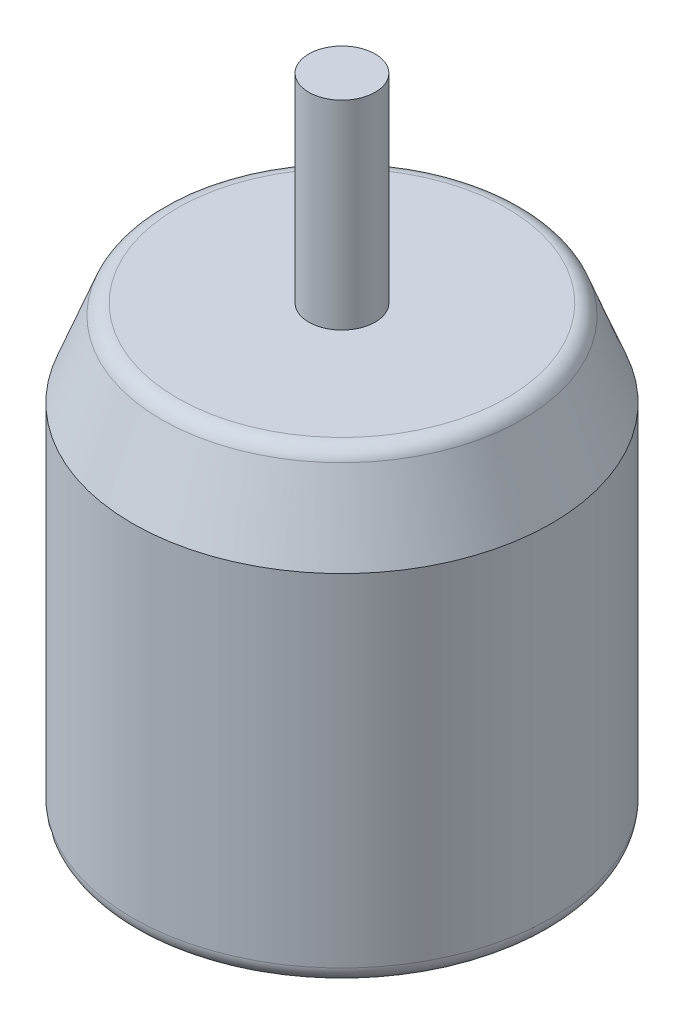
ISO-10303-21;
HEADER;
FILE_DESCRIPTION(('STEP AP214'),'2;1');
FILE_NAME('part.step','',(''),(''),'','','');
FILE_SCHEMA(('AUTOMOTIVE_DESIGN { 1 0 10303 214 1 1 1 1 }'));
ENDSEC;
DATA;
#1=APPLICATION_CONTEXT('core data for automotive mechanical design processes');
#2=APPLICATION_PROTOCOL_DEFINITION('international standard','automotive_design',2000,#1);
#3=PRODUCT_CONTEXT('',#1,'mechanical');
#4=PRODUCT('Part','Part','',(#3));
#5=PRODUCT_RELATED_PRODUCT_CATEGORY('part','',(#4));
#6=PRODUCT_DEFINITION_FORMATION('','',#4);
#7=PRODUCT_DEFINITION_CONTEXT('part definition',#1,'design');
#8=PRODUCT_DEFINITION('design','',#6,#7);
#9=PRODUCT_DEFINITION_SHAPE('','',#8);
#10=(LENGTH_UNIT() NAMED_UNIT(*) SI_UNIT(.MILLI.,.METRE.));
#11=(NAMED_UNIT(*) PLANE_ANGLE_UNIT() SI_UNIT($,.RADIAN.));
#12=(NAMED_UNIT(*) SI_UNIT($,.STERADIAN.) SOLID_ANGLE_UNIT());
#13=UNCERTAINTY_MEASURE_WITH_UNIT(LENGTH_MEASURE(1.E-05),#10,'distance_accuracy_value','');
#14=(GEOMETRIC_REPRESENTATION_CONTEXT(3) GLOBAL_UNCERTAINTY_ASSIGNED_CONTEXT((#13)) GLOBAL_UNIT_ASSIGNED_CONTEXT((#10,
#11,#12)) REPRESENTATION_CONTEXT('',''));
#15=CARTESIAN_POINT('',(0.,0.,0.));
#16=DIRECTION('',(0.,0.,1.));
#17=DIRECTION('',(1.,0.,0.));
#18=AXIS2_PLACEMENT_3D('',#15,#16,#17);
#19=CARTESIAN_POINT('',(0.,13.,0.));
#20=DIRECTION('',(0.,-1.,0.));
#21=DIRECTION('',(0.,0.,-1.));
#22=AXIS2_PLACEMENT_3D('',#19,#20,#21);
#23=CONICAL_SURFACE('',#22,26.55,0.367173833818219);
#24=CARTESIAN_POINT('',(0.,11.3718068614445,0.));
#25=DIRECTION('',(0.,1.,0.));
#26=DIRECTION('',(0.,0.,1.));
#27=AXIS2_PLACEMENT_3D('',#24,#25,#26);
#28=CIRCLE('',#27,27.1762281302136);
#29=CARTESIAN_POINT('',(0.,11.3718068614445,27.1762281302136));
#30=VERTEX_POINT('',#29);
#31=EDGE_CURVE('E10',#30,#30,#28,.F.);
#32=ORIENTED_EDGE('',*,*,#31,.T.);
#33=EDGE_LOOP('',(#32));
#34=FACE_BOUND('',#33,.T.);
#35=CARTESIAN_POINT('',(0.,0.,0.));
#36=DIRECTION('',(0.,-1.,0.));
#37=DIRECTION('',(0.,0.,-1.));
#38=AXIS2_PLACEMENT_3D('',#35,#36,#37);
#39=CIRCLE('',#38,31.55);
#40=CARTESIAN_POINT('',(0.,0.,-31.55));
#41=VERTEX_POINT('',#40);
#42=EDGE_CURVE('E52',#41,#41,#39,.T.);
#43=ORIENTED_EDGE('',*,*,#42,.F.);
#44=EDGE_LOOP('',(#43));
#45=FACE_BOUND('',#44,.T.);
#46=ADVANCED_FACE('F32',(#34,#45),#23,.T.);
#47=CARTESIAN_POINT('',(0.,13.,0.));
#48=DIRECTION('',(0.,1.,0.));
#49=DIRECTION('',(0.,0.,1.));
#50=AXIS2_PLACEMENT_3D('',#47,#48,#49);
#51=PLANE('',#50);
#52=CARTESIAN_POINT('',(0.,13.,0.));
#53=DIRECTION('',(0.,1.,0.));
#54=DIRECTION('',(0.,0.,1.));
#55=AXIS2_PLACEMENT_3D('',#52,#53,#54);
#56=CIRCLE('',#55,5.);
#57=CARTESIAN_POINT('',(0.,13.,5.));
#58=VERTEX_POINT('',#57);
#59=EDGE_CURVE('E56',#58,#58,#56,.T.);
#60=ORIENTED_EDGE('',*,*,#59,.F.);
#61=EDGE_LOOP('',(#60));
#62=FACE_BOUND('',#61,.T.);
#63=CARTESIAN_POINT('',(0.,13.,0.));
#64=DIRECTION('',(0.,1.,0.));
#65=DIRECTION('',(0.,0.,1.));
#66=AXIS2_PLACEMENT_3D('',#63,#64,#65);
#67=CIRCLE('',#66,24.8055302904579);
#68=CARTESIAN_POINT('',(0.,13.,24.8055302904579));
#69=VERTEX_POINT('',#68);
#70=EDGE_CURVE('E39',#69,#69,#67,.T.);
#71=ORIENTED_EDGE('',*,*,#70,.T.);
#72=EDGE_LOOP('',(#71));
#73=FACE_BOUND('',#72,.T.);
#74=ADVANCED_FACE('F70',(#62,#73),#51,.T.);
#75=CARTESIAN_POINT('',(0.,-54.,0.));
#76=DIRECTION('',(0.,1.,0.));
#77=DIRECTION('',(0.,0.,1.));
#78=AXIS2_PLACEMENT_3D('',#75,#76,#77);
#79=CYLINDRICAL_SURFACE('',#78,31.55);
#80=CARTESIAN_POINT('',(0.,-51.46,0.));
#81=DIRECTION('',(0.,-1.,0.));
#82=DIRECTION('',(0.,0.,-1.));
#83=AXIS2_PLACEMENT_3D('',#80,#81,#82);
#84=CIRCLE('',#83,31.55);
#85=CARTESIAN_POINT('',(0.,-51.46,-31.55));
#86=VERTEX_POINT('',#85);
#87=EDGE_CURVE('E43',#86,#86,#84,.F.);
#88=ORIENTED_EDGE('',*,*,#87,.T.);
#89=EDGE_LOOP('',(#88));
#90=FACE_BOUND('',#89,.T.);
#91=ORIENTED_EDGE('',*,*,#42,.T.);
#92=EDGE_LOOP('',(#91));
#93=FACE_BOUND('',#92,.T.);
#94=ADVANCED_FACE('F72',(#90,#93),#79,.T.);
#95=CARTESIAN_POINT('',(0.,-54.,0.));
#96=DIRECTION('',(0.,-1.,0.));
#97=DIRECTION('',(0.,0.,-1.));
#98=AXIS2_PLACEMENT_3D('',#95,#96,#97);
#99=PLANE('',#98);
#100=CARTESIAN_POINT('',(0.,-54.,0.));
#101=DIRECTION('',(0.,-1.,0.));
#102=DIRECTION('',(0.,0.,-1.));
#103=AXIS2_PLACEMENT_3D('',#100,#101,#102);
#104=CIRCLE('',#103,29.01);
#105=CARTESIAN_POINT('',(0.,-54.,-29.01));
#106=VERTEX_POINT('',#105);
#107=EDGE_CURVE('E47',#106,#106,#104,.T.);
#108=ORIENTED_EDGE('',*,*,#107,.T.);
#109=EDGE_LOOP('',(#108));
#110=FACE_BOUND('',#109,.T.);
#111=ADVANCED_FACE('F78',(#110),#99,.T.);
#112=CARTESIAN_POINT('',(0.,-51.46,0.));
#113=DIRECTION('',(0.,-1.,0.));
#114=DIRECTION('',(0.,0.,-1.));
#115=AXIS2_PLACEMENT_3D('',#112,#113,#114);
#116=TOROIDAL_SURFACE('',#115,29.01,2.54);
#117=ORIENTED_EDGE('',*,*,#87,.F.);
#118=EDGE_LOOP('',(#117));
#119=FACE_BOUND('',#118,.T.);
#120=ORIENTED_EDGE('',*,*,#107,.F.);
#121=EDGE_LOOP('',(#120));
#122=FACE_BOUND('',#121,.T.);
#123=ADVANCED_FACE('F82',(#119,#122),#116,.T.);
#124=CARTESIAN_POINT('',(0.,10.46,0.));
#125=DIRECTION('',(0.,1.,0.));
#126=DIRECTION('',(0.,0.,1.));
#127=AXIS2_PLACEMENT_3D('',#124,#125,#126);
#128=TOROIDAL_SURFACE('',#127,24.8055302904579,2.54);
#129=ORIENTED_EDGE('',*,*,#31,.F.);
#130=EDGE_LOOP('',(#129));
#131=FACE_BOUND('',#130,.T.);
#132=ORIENTED_EDGE('',*,*,#70,.F.);
#133=EDGE_LOOP('',(#132));
#134=FACE_BOUND('',#133,.T.);
#135=ADVANCED_FACE('F34',(#131,#134),#128,.T.);
#136=CARTESIAN_POINT('',(0.,43.,0.));
#137=DIRECTION('',(0.,-1.,0.));
#138=DIRECTION('',(0.,0.,-1.));
#139=AXIS2_PLACEMENT_3D('',#136,#137,#138);
#140=CYLINDRICAL_SURFACE('',#139,5.);
#141=CARTESIAN_POINT('',(0.,43.,0.));
#142=DIRECTION('',(0.,1.,0.));
#143=DIRECTION('',(0.,0.,1.));
#144=AXIS2_PLACEMENT_3D('',#141,#142,#143);
#145=CIRCLE('',#144,5.);
#146=CARTESIAN_POINT('',(0.,43.,5.));
#147=VERTEX_POINT('',#146);
#148=EDGE_CURVE('E55',#147,#147,#145,.T.);
#149=ORIENTED_EDGE('',*,*,#148,.F.);
#150=EDGE_LOOP('',(#149));
#151=FACE_BOUND('',#150,.T.);
#152=ORIENTED_EDGE('',*,*,#59,.T.);
#153=EDGE_LOOP('',(#152));
#154=FACE_BOUND('',#153,.T.);
#155=ADVANCED_FACE('F64',(#151,#154),#140,.T.);
#156=CARTESIAN_POINT('',(0.,43.,0.));
#157=DIRECTION('',(0.,1.,0.));
#158=DIRECTION('',(0.,0.,1.));
#159=AXIS2_PLACEMENT_3D('',#156,#157,#158);
#160=PLANE('',#159);
#161=ORIENTED_EDGE('',*,*,#148,.T.);
#162=EDGE_LOOP('',(#161));
#163=FACE_BOUND('',#162,.T.);
#164=ADVANCED_FACE('F62',(#163),#160,.T.);
#165=CLOSED_SHELL('',(#46,#74,#94,#111,#123,#135,#155,#164));
#166=MANIFOLD_SOLID_BREP('B2',#165);
#167=ADVANCED_BREP_SHAPE_REPRESENTATION('',(#18,#166),#14);
#168=SHAPE_DEFINITION_REPRESENTATION(#9,#167);
ENDSEC;
END-ISO-10303-21;
